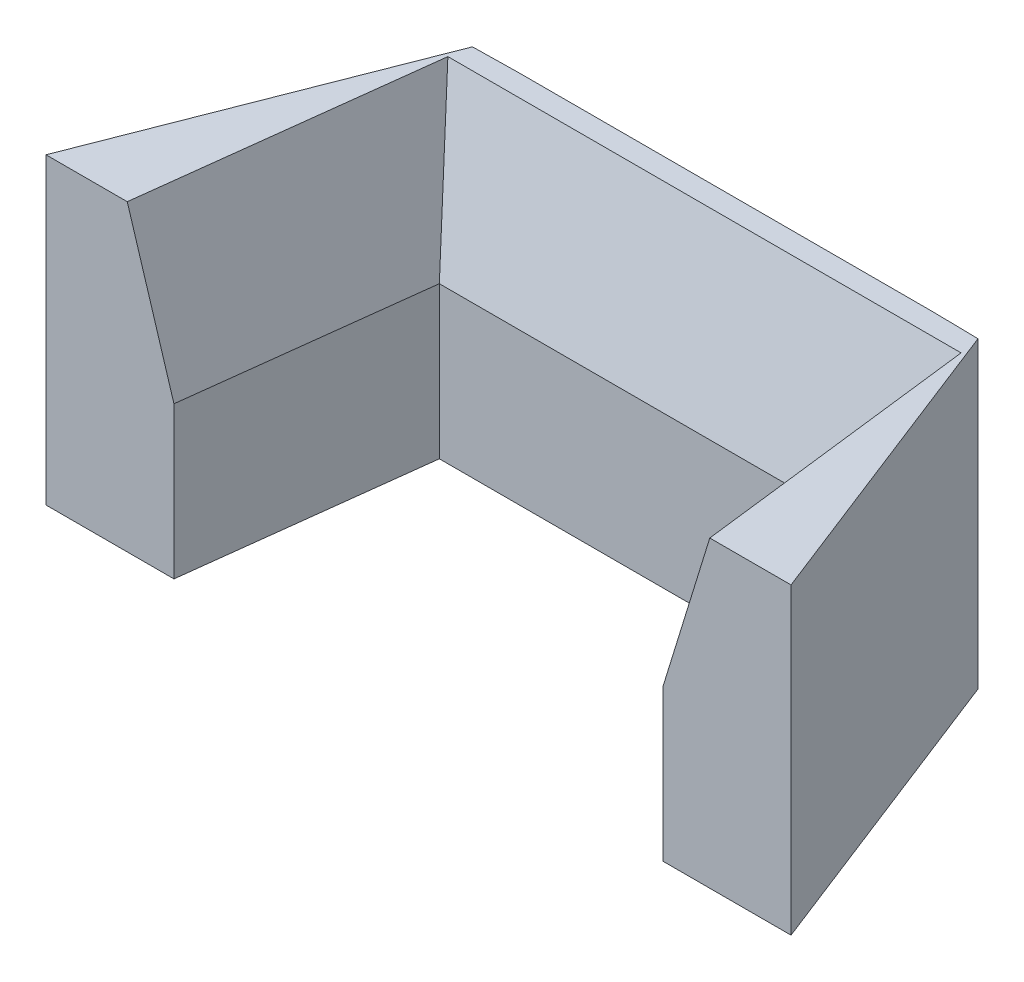
ISO-10303-21;
HEADER;
FILE_DESCRIPTION(('STEP AP214'),'2;1');
FILE_NAME('part.step','',(''),(''),'','','');
FILE_SCHEMA(('AUTOMOTIVE_DESIGN { 1 0 10303 214 1 1 1 1 }'));
ENDSEC;
DATA;
#1=APPLICATION_CONTEXT('core data for automotive mechanical design processes');
#2=APPLICATION_PROTOCOL_DEFINITION('international standard','automotive_design',2000,#1);
#3=PRODUCT_CONTEXT('',#1,'mechanical');
#4=PRODUCT('Part','Part','',(#3));
#5=PRODUCT_RELATED_PRODUCT_CATEGORY('part','',(#4));
#6=PRODUCT_DEFINITION_FORMATION('','',#4);
#7=PRODUCT_DEFINITION_CONTEXT('part definition',#1,'design');
#8=PRODUCT_DEFINITION('design','',#6,#7);
#9=PRODUCT_DEFINITION_SHAPE('','',#8);
#10=(LENGTH_UNIT() NAMED_UNIT(*) SI_UNIT(.MILLI.,.METRE.));
#11=(NAMED_UNIT(*) PLANE_ANGLE_UNIT() SI_UNIT($,.RADIAN.));
#12=(NAMED_UNIT(*) SI_UNIT($,.STERADIAN.) SOLID_ANGLE_UNIT());
#13=UNCERTAINTY_MEASURE_WITH_UNIT(LENGTH_MEASURE(1.E-05),#10,'distance_accuracy_value','');
#14=(GEOMETRIC_REPRESENTATION_CONTEXT(3) GLOBAL_UNCERTAINTY_ASSIGNED_CONTEXT((#13)) GLOBAL_UNIT_ASSIGNED_CONTEXT((#10,
#11,#12)) REPRESENTATION_CONTEXT('',''));
#15=CARTESIAN_POINT('',(0.,0.,0.));
#16=DIRECTION('',(0.,0.,1.));
#17=DIRECTION('',(1.,0.,0.));
#18=AXIS2_PLACEMENT_3D('',#15,#16,#17);
#19=CARTESIAN_POINT('',(0.,0.,0.));
#20=DIRECTION('',(0.,1.,0.));
#21=DIRECTION('',(0.,0.,1.));
#22=AXIS2_PLACEMENT_3D('',#19,#20,#21);
#23=PLANE('',#22);
#24=DIRECTION('',(0.363647232726733,0.,0.931536735792094));
#25=VECTOR('',#24,1.);
#26=CARTESIAN_POINT('',(55.1775190113047,0.,-21.5398398433811));
#27=LINE('',#26,#25);
#28=CARTESIAN_POINT('',(49.793050571942,0.,-35.3329604904691));
#29=VERTEX_POINT('',#28);
#30=CARTESIAN_POINT('',(61.6342337684254,0.,-5.));
#31=VERTEX_POINT('',#30);
#32=EDGE_CURVE('E221',#29,#31,#27,.T.);
#33=ORIENTED_EDGE('',*,*,#32,.T.);
#34=DIRECTION('',(-1.,0.,0.));
#35=VECTOR('',#34,1.);
#36=CARTESIAN_POINT('',(0.,0.,-5.));
#37=LINE('',#36,#35);
#38=CARTESIAN_POINT('',(48.9798849353082,0.,-5.));
#39=VERTEX_POINT('',#38);
#40=EDGE_CURVE('E249',#31,#39,#37,.T.);
#41=ORIENTED_EDGE('',*,*,#40,.T.);
#42=DIRECTION('',(-0.120361814384752,0.,-0.992730091030795));
#43=VECTOR('',#42,1.);
#44=CARTESIAN_POINT('',(48.8677489645903,0.,-5.92488429978922));
#45=LINE('',#44,#43);
#46=CARTESIAN_POINT('',(46.141753263948,0.,-28.4085762737028));
#47=VERTEX_POINT('',#46);
#48=EDGE_CURVE('E218',#39,#47,#45,.T.);
#49=ORIENTED_EDGE('',*,*,#48,.T.);
#50=DIRECTION('',(1.,0.,0.));
#51=VECTOR('',#50,1.);
#52=CARTESIAN_POINT('',(0.,0.,-28.4085762737027));
#53=LINE('',#52,#51);
#54=CARTESIAN_POINT('',(3.44434787993589,0.,-28.4085762737027));
#55=VERTEX_POINT('',#54);
#56=EDGE_CURVE('E215',#55,#47,#53,.T.);
#57=ORIENTED_EDGE('',*,*,#56,.F.);
#58=DIRECTION('',(0.120361814384752,0.,-0.992730091030795));
#59=VECTOR('',#58,1.);
#60=CARTESIAN_POINT('',(0.,0.,0.));
#61=LINE('',#60,#59);
#62=CARTESIAN_POINT('',(0.606216208575733,0.,-5.));
#63=VERTEX_POINT('',#62);
#64=EDGE_CURVE('E197',#63,#55,#61,.T.);
#65=ORIENTED_EDGE('',*,*,#64,.F.);
#66=CARTESIAN_POINT('',(-12.0481326245415,0.,-5.));
#67=VERTEX_POINT('',#66);
#68=EDGE_CURVE('E246',#63,#67,#37,.T.);
#69=ORIENTED_EDGE('',*,*,#68,.T.);
#70=DIRECTION('',(-0.363647232726733,0.,0.931536735792094));
#71=VECTOR('',#70,1.);
#72=CARTESIAN_POINT('',(-12.1486496618227,0.,-4.74251058615724));
#73=LINE('',#72,#71);
#74=CARTESIAN_POINT('',(-0.206949428058042,0.,-35.3329604904691));
#75=VERTEX_POINT('',#74);
#76=EDGE_CURVE('E202',#75,#67,#73,.T.);
#77=ORIENTED_EDGE('',*,*,#76,.F.);
#78=DIRECTION('',(-0.99985885095998,0.,0.0168011355863105));
#79=VECTOR('',#78,1.);
#80=CARTESIAN_POINT('',(-0.593608486319822,0.,-35.3264632621281));
#81=LINE('',#80,#79);
#82=CARTESIAN_POINT('',(4.29305057194196,0.,-35.4085762737027));
#83=VERTEX_POINT('',#82);
#84=EDGE_CURVE('E229',#83,#75,#81,.T.);
#85=ORIENTED_EDGE('',*,*,#84,.F.);
#86=DIRECTION('',(-1.,0.,0.));
#87=VECTOR('',#86,1.);
#88=CARTESIAN_POINT('',(0.,0.,-35.4085762737027));
#89=LINE('',#88,#87);
#90=CARTESIAN_POINT('',(45.293050571942,0.,-35.4085762737027));
#91=VERTEX_POINT('',#90);
#92=EDGE_CURVE('E227',#91,#83,#89,.T.);
#93=ORIENTED_EDGE('',*,*,#92,.F.);
#94=DIRECTION('',(0.99985885095998,0.,0.016801135586312));
#95=VECTOR('',#94,1.);
#96=CARTESIAN_POINT('',(0.607605559563074,0.,-36.1594484789814));
#97=LINE('',#96,#95);
#98=EDGE_CURVE('E224',#91,#29,#97,.T.);
#99=ORIENTED_EDGE('',*,*,#98,.T.);
#100=EDGE_LOOP('',(#33,#41,#49,#57,#65,#69,#77,#85,#93,#99));
#101=FACE_BOUND('',#100,.T.);
#102=DIRECTION('',(0.,0.,-1.));
#103=VECTOR('',#102,1.);
#104=CARTESIAN_POINT('',(14.793050571942,0.,-31.4085762737027));
#105=LINE('',#104,#103);
#106=CARTESIAN_POINT('',(14.793050571942,0.,-31.4085762737027));
#107=VERTEX_POINT('',#106);
#108=CARTESIAN_POINT('',(14.793050571942,0.,-33.4085762737027));
#109=VERTEX_POINT('',#108);
#110=EDGE_CURVE('E178',#107,#109,#105,.T.);
#111=ORIENTED_EDGE('',*,*,#110,.F.);
#112=DIRECTION('',(-1.,0.,0.));
#113=VECTOR('',#112,1.);
#114=CARTESIAN_POINT('',(14.793050571942,0.,-31.4085762737027));
#115=LINE('',#114,#113);
#116=CARTESIAN_POINT('',(34.793050571942,0.,-31.4085762737027));
#117=VERTEX_POINT('',#116);
#118=EDGE_CURVE('E175',#117,#107,#115,.T.);
#119=ORIENTED_EDGE('',*,*,#118,.F.);
#120=DIRECTION('',(0.,0.,1.));
#121=VECTOR('',#120,1.);
#122=CARTESIAN_POINT('',(34.793050571942,0.,-31.4085762737027));
#123=LINE('',#122,#121);
#124=CARTESIAN_POINT('',(34.793050571942,0.,-33.4085762737027));
#125=VERTEX_POINT('',#124);
#126=EDGE_CURVE('E512',#125,#117,#123,.T.);
#127=ORIENTED_EDGE('',*,*,#126,.F.);
#128=DIRECTION('',(1.,0.,0.));
#129=VECTOR('',#128,1.);
#130=CARTESIAN_POINT('',(14.793050571942,0.,-33.4085762737027));
#131=LINE('',#130,#129);
#132=EDGE_CURVE('E518',#109,#125,#131,.T.);
#133=ORIENTED_EDGE('',*,*,#132,.F.);
#134=EDGE_LOOP('',(#111,#119,#127,#133));
#135=FACE_BOUND('',#134,.T.);
#136=ADVANCED_FACE('F39',(#101,#135),#23,.F.);
#137=CARTESIAN_POINT('',(0.,30.,0.));
#138=DIRECTION('',(-0.992730091030795,0.,-0.120361814384752));
#139=DIRECTION('',(-0.120361814384752,0.,0.992730091030795));
#140=AXIS2_PLACEMENT_3D('',#137,#138,#139);
#141=PLANE('',#140);
#142=DIRECTION('',(0.,-1.,0.));
#143=VECTOR('',#142,1.);
#144=CARTESIAN_POINT('',(3.44434787993589,30.,-28.4085762737027));
#145=LINE('',#144,#143);
#146=CARTESIAN_POINT('',(3.44434787993589,14.9999999999998,-28.4085762737027));
#147=VERTEX_POINT('',#146);
#148=EDGE_CURVE('E244',#147,#55,#145,.T.);
#149=ORIENTED_EDGE('',*,*,#148,.F.);
#150=DIRECTION('',(-0.120361814384752,0.,0.992730091030795));
#151=VECTOR('',#150,1.);
#152=CARTESIAN_POINT('',(0.606216208575762,14.9999999999998,-5.));
#153=LINE('',#152,#151);
#154=CARTESIAN_POINT('',(0.606216208575763,14.9999999999998,-5.));
#155=VERTEX_POINT('',#154);
#156=EDGE_CURVE('E251',#147,#155,#153,.T.);
#157=ORIENTED_EDGE('',*,*,#156,.T.);
#158=DIRECTION('',(0.,-1.,0.));
#159=VECTOR('',#158,1.);
#160=CARTESIAN_POINT('',(0.606216208575763,30.,-5.));
#161=LINE('',#160,#159);
#162=EDGE_CURVE('E195',#155,#63,#161,.T.);
#163=ORIENTED_EDGE('',*,*,#162,.T.);
#164=ORIENTED_EDGE('',*,*,#64,.T.);
#165=EDGE_LOOP('',(#149,#157,#163,#164));
#166=FACE_BOUND('',#165,.T.);
#167=ADVANCED_FACE('F285',(#166),#141,.F.);
#168=CARTESIAN_POINT('',(0.,30.,-28.4085762737027));
#169=DIRECTION('',(0.,0.,-1.));
#170=DIRECTION('',(-1.,0.,0.));
#171=AXIS2_PLACEMENT_3D('',#168,#169,#170);
#172=PLANE('',#171);
#173=DIRECTION('',(0.,-1.,0.));
#174=VECTOR('',#173,1.);
#175=CARTESIAN_POINT('',(46.141753263948,30.,-28.4085762737028));
#176=LINE('',#175,#174);
#177=CARTESIAN_POINT('',(46.141753263948,14.9999999999998,-28.4085762737028));
#178=VERTEX_POINT('',#177);
#179=EDGE_CURVE('E242',#178,#47,#176,.T.);
#180=ORIENTED_EDGE('',*,*,#179,.F.);
#181=DIRECTION('',(-1.,0.,0.));
#182=VECTOR('',#181,1.);
#183=CARTESIAN_POINT('',(-1.17519600547017,14.9999999999998,-28.4085762737027));
#184=LINE('',#183,#182);
#185=EDGE_CURVE('E263',#178,#147,#184,.T.);
#186=ORIENTED_EDGE('',*,*,#185,.T.);
#187=ORIENTED_EDGE('',*,*,#148,.T.);
#188=ORIENTED_EDGE('',*,*,#56,.T.);
#189=EDGE_LOOP('',(#180,#186,#187,#188));
#190=FACE_BOUND('',#189,.T.);
#191=ADVANCED_FACE('F275',(#190),#172,.F.);
#192=CARTESIAN_POINT('',(48.8677489645903,30.,-5.92488429978922));
#193=DIRECTION('',(-0.992730091030795,0.,0.120361814384752));
#194=DIRECTION('',(0.120361814384752,0.,0.992730091030795));
#195=AXIS2_PLACEMENT_3D('',#192,#193,#194);
#196=PLANE('',#195);
#197=DIRECTION('',(0.,-1.,0.));
#198=VECTOR('',#197,1.);
#199=CARTESIAN_POINT('',(48.9798849353082,30.,-5.));
#200=LINE('',#199,#198);
#201=CARTESIAN_POINT('',(48.9798849353082,14.9999999999998,-5.));
#202=VERTEX_POINT('',#201);
#203=EDGE_CURVE('E193',#202,#39,#200,.T.);
#204=ORIENTED_EDGE('',*,*,#203,.F.);
#205=DIRECTION('',(-0.120361814384752,0.,-0.992730091030795));
#206=VECTOR('',#205,1.);
#207=CARTESIAN_POINT('',(48.8677489645903,14.9999999999998,-5.92488429978922));
#208=LINE('',#207,#206);
#209=EDGE_CURVE('E255',#202,#178,#208,.T.);
#210=ORIENTED_EDGE('',*,*,#209,.T.);
#211=ORIENTED_EDGE('',*,*,#179,.T.);
#212=ORIENTED_EDGE('',*,*,#48,.F.);
#213=EDGE_LOOP('',(#204,#210,#211,#212));
#214=FACE_BOUND('',#213,.T.);
#215=ADVANCED_FACE('F272',(#214),#196,.T.);
#216=CARTESIAN_POINT('',(55.1775190113047,30.,-21.5398398433811));
#217=DIRECTION('',(0.931536735792094,0.,-0.363647232726733));
#218=DIRECTION('',(-0.363647232726733,0.,-0.931536735792094));
#219=AXIS2_PLACEMENT_3D('',#216,#217,#218);
#220=PLANE('',#219);
#221=DIRECTION('',(0.,1.,0.));
#222=VECTOR('',#221,1.);
#223=CARTESIAN_POINT('',(61.6342337684255,30.,-5.));
#224=LINE('',#223,#222);
#225=CARTESIAN_POINT('',(61.6342337684254,30.,-5.));
#226=VERTEX_POINT('',#225);
#227=EDGE_CURVE('E190',#31,#226,#224,.T.);
#228=ORIENTED_EDGE('',*,*,#227,.F.);
#229=ORIENTED_EDGE('',*,*,#32,.F.);
#230=DIRECTION('',(0.,-1.,0.));
#231=VECTOR('',#230,1.);
#232=CARTESIAN_POINT('',(49.793050571942,30.,-35.3329604904691));
#233=LINE('',#232,#231);
#234=CARTESIAN_POINT('',(49.793050571942,30.,-35.3329604904691));
#235=VERTEX_POINT('',#234);
#236=EDGE_CURVE('E240',#235,#29,#233,.T.);
#237=ORIENTED_EDGE('',*,*,#236,.F.);
#238=DIRECTION('',(0.363647232726733,0.,0.931536735792094));
#239=VECTOR('',#238,1.);
#240=CARTESIAN_POINT('',(55.1775190113047,30.,-21.5398398433811));
#241=LINE('',#240,#239);
#242=EDGE_CURVE('E198',#235,#226,#241,.T.);
#243=ORIENTED_EDGE('',*,*,#242,.T.);
#244=EDGE_LOOP('',(#228,#229,#237,#243));
#245=FACE_BOUND('',#244,.T.);
#246=ADVANCED_FACE('F300',(#245),#220,.T.);
#247=CARTESIAN_POINT('',(0.607605559563074,30.,-36.1594484789814));
#248=DIRECTION('',(0.016801135586312,0.,-0.999858850959979));
#249=DIRECTION('',(-0.99985885095998,0.,-0.016801135586312));
#250=AXIS2_PLACEMENT_3D('',#247,#248,#249);
#251=PLANE('',#250);
#252=ORIENTED_EDGE('',*,*,#98,.F.);
#253=DIRECTION('',(0.,-1.,0.));
#254=VECTOR('',#253,1.);
#255=CARTESIAN_POINT('',(45.293050571942,30.,-35.4085762737027));
#256=LINE('',#255,#254);
#257=CARTESIAN_POINT('',(45.293050571942,30.,-35.4085762737027));
#258=VERTEX_POINT('',#257);
#259=EDGE_CURVE('E238',#258,#91,#256,.T.);
#260=ORIENTED_EDGE('',*,*,#259,.F.);
#261=DIRECTION('',(0.99985885095998,0.,0.016801135586312));
#262=VECTOR('',#261,1.);
#263=CARTESIAN_POINT('',(0.607605559563074,30.,-36.1594484789814));
#264=LINE('',#263,#262);
#265=EDGE_CURVE('E201',#258,#235,#264,.T.);
#266=ORIENTED_EDGE('',*,*,#265,.T.);
#267=ORIENTED_EDGE('',*,*,#236,.T.);
#268=EDGE_LOOP('',(#252,#260,#266,#267));
#269=FACE_BOUND('',#268,.T.);
#270=ADVANCED_FACE('F306',(#269),#251,.T.);
#271=CARTESIAN_POINT('',(0.,30.,-35.4085762737027));
#272=DIRECTION('',(0.,0.,1.));
#273=DIRECTION('',(1.,0.,0.));
#274=AXIS2_PLACEMENT_3D('',#271,#272,#273);
#275=PLANE('',#274);
#276=ORIENTED_EDGE('',*,*,#92,.T.);
#277=DIRECTION('',(0.,-1.,0.));
#278=VECTOR('',#277,1.);
#279=CARTESIAN_POINT('',(4.29305057194196,30.,-35.4085762737027));
#280=LINE('',#279,#278);
#281=CARTESIAN_POINT('',(4.29305057194196,30.,-35.4085762737027));
#282=VERTEX_POINT('',#281);
#283=EDGE_CURVE('E235',#282,#83,#280,.T.);
#284=ORIENTED_EDGE('',*,*,#283,.F.);
#285=DIRECTION('',(-1.,0.,0.));
#286=VECTOR('',#285,1.);
#287=CARTESIAN_POINT('',(0.,30.,-35.4085762737027));
#288=LINE('',#287,#286);
#289=EDGE_CURVE('E205',#258,#282,#288,.T.);
#290=ORIENTED_EDGE('',*,*,#289,.F.);
#291=ORIENTED_EDGE('',*,*,#259,.T.);
#292=EDGE_LOOP('',(#276,#284,#290,#291));
#293=FACE_BOUND('',#292,.T.);
#294=ADVANCED_FACE('F311',(#293),#275,.F.);
#295=CARTESIAN_POINT('',(-0.593608486319822,30.,-35.3264632621281));
#296=DIRECTION('',(0.0168011355863105,0.,0.99985885095998));
#297=DIRECTION('',(0.99985885095998,0.,-0.0168011355863105));
#298=AXIS2_PLACEMENT_3D('',#295,#296,#297);
#299=PLANE('',#298);
#300=ORIENTED_EDGE('',*,*,#84,.T.);
#301=DIRECTION('',(0.,-1.,0.));
#302=VECTOR('',#301,1.);
#303=CARTESIAN_POINT('',(-0.206949428058042,30.,-35.3329604904691));
#304=LINE('',#303,#302);
#305=CARTESIAN_POINT('',(-0.206949428058042,30.,-35.3329604904691));
#306=VERTEX_POINT('',#305);
#307=EDGE_CURVE('E212',#306,#75,#304,.T.);
#308=ORIENTED_EDGE('',*,*,#307,.F.);
#309=DIRECTION('',(-0.99985885095998,0.,0.0168011355863105));
#310=VECTOR('',#309,1.);
#311=CARTESIAN_POINT('',(-0.593608486319822,30.,-35.3264632621281));
#312=LINE('',#311,#310);
#313=EDGE_CURVE('E207',#282,#306,#312,.T.);
#314=ORIENTED_EDGE('',*,*,#313,.F.);
#315=ORIENTED_EDGE('',*,*,#283,.T.);
#316=EDGE_LOOP('',(#300,#308,#314,#315));
#317=FACE_BOUND('',#316,.T.);
#318=ADVANCED_FACE('F316',(#317),#299,.F.);
#319=CARTESIAN_POINT('',(-12.1486496618227,30.,-4.74251058615724));
#320=DIRECTION('',(0.931536735792094,0.,0.363647232726733));
#321=DIRECTION('',(0.363647232726733,0.,-0.931536735792094));
#322=AXIS2_PLACEMENT_3D('',#319,#320,#321);
#323=PLANE('',#322);
#324=ORIENTED_EDGE('',*,*,#76,.T.);
#325=DIRECTION('',(0.,1.,0.));
#326=VECTOR('',#325,1.);
#327=CARTESIAN_POINT('',(-12.0481326245415,30.,-5.));
#328=LINE('',#327,#326);
#329=CARTESIAN_POINT('',(-12.0481326245416,30.,-5.));
#330=VERTEX_POINT('',#329);
#331=EDGE_CURVE('E187',#67,#330,#328,.T.);
#332=ORIENTED_EDGE('',*,*,#331,.T.);
#333=DIRECTION('',(-0.363647232726733,0.,0.931536735792094));
#334=VECTOR('',#333,1.);
#335=CARTESIAN_POINT('',(-12.1486496618227,30.,-4.74251058615724));
#336=LINE('',#335,#334);
#337=EDGE_CURVE('E209',#306,#330,#336,.T.);
#338=ORIENTED_EDGE('',*,*,#337,.F.);
#339=ORIENTED_EDGE('',*,*,#307,.T.);
#340=EDGE_LOOP('',(#324,#332,#338,#339));
#341=FACE_BOUND('',#340,.T.);
#342=ADVANCED_FACE('F319',(#341),#323,.F.);
#343=CARTESIAN_POINT('',(0.,30.,0.));
#344=DIRECTION('',(0.,1.,0.));
#345=DIRECTION('',(0.,0.,1.));
#346=AXIS2_PLACEMENT_3D('',#343,#344,#345);
#347=PLANE('',#346);
#348=DIRECTION('',(1.,0.,0.));
#349=VECTOR('',#348,1.);
#350=CARTESIAN_POINT('',(50.7612971493541,30.,-33.2823717171964));
#351=LINE('',#350,#349);
#352=CARTESIAN_POINT('',(-0.584281246444469,30.,-33.2823717171963));
#353=VERTEX_POINT('',#352);
#354=CARTESIAN_POINT('',(50.1703823903284,30.,-33.2823717171964));
#355=VERTEX_POINT('',#354);
#356=EDGE_CURVE('E261',#353,#355,#351,.T.);
#357=ORIENTED_EDGE('',*,*,#356,.T.);
#358=DIRECTION('',(0.120361814384752,0.,0.992730091030795));
#359=VECTOR('',#358,1.);
#360=CARTESIAN_POINT('',(53.4203696731207,30.,-6.47685879279098));
#361=LINE('',#360,#359);
#362=CARTESIAN_POINT('',(53.5994288207142,30.,-5.));
#363=VERTEX_POINT('',#362);
#364=EDGE_CURVE('E55',#355,#363,#361,.T.);
#365=ORIENTED_EDGE('',*,*,#364,.T.);
#366=DIRECTION('',(1.,0.,0.));
#367=VECTOR('',#366,1.);
#368=CARTESIAN_POINT('',(-90.,30.,-5.));
#369=LINE('',#368,#367);
#370=EDGE_CURVE('E179',#363,#226,#369,.T.);
#371=ORIENTED_EDGE('',*,*,#370,.T.);
#372=ORIENTED_EDGE('',*,*,#242,.F.);
#373=ORIENTED_EDGE('',*,*,#265,.F.);
#374=ORIENTED_EDGE('',*,*,#289,.T.);
#375=ORIENTED_EDGE('',*,*,#313,.T.);
#376=ORIENTED_EDGE('',*,*,#337,.T.);
#377=CARTESIAN_POINT('',(-4.01332767683033,30.,-5.));
#378=VERTEX_POINT('',#377);
#379=EDGE_CURVE('E181',#330,#378,#369,.T.);
#380=ORIENTED_EDGE('',*,*,#379,.T.);
#381=DIRECTION('',(0.120361814384752,0.,-0.992730091030795));
#382=VECTOR('',#381,1.);
#383=CARTESIAN_POINT('',(-1.10827282859456,30.,-28.9605507667045));
#384=LINE('',#383,#382);
#385=EDGE_CURVE('E63',#378,#353,#384,.T.);
#386=ORIENTED_EDGE('',*,*,#385,.T.);
#387=EDGE_LOOP('',(#357,#365,#371,#372,#373,#374,#375,#376,#380,#386));
#388=FACE_BOUND('',#387,.T.);
#389=ADVANCED_FACE('F303',(#388),#347,.T.);
#390=CARTESIAN_POINT('',(-90.,0.,-5.));
#391=DIRECTION('',(0.,0.,-1.));
#392=DIRECTION('',(-1.,0.,0.));
#393=AXIS2_PLACEMENT_3D('',#390,#391,#392);
#394=PLANE('',#393);
#395=ORIENTED_EDGE('',*,*,#162,.F.);
#396=DIRECTION('',(-0.294327922497503,0.955704490958531,0.));
#397=VECTOR('',#396,1.);
#398=CARTESIAN_POINT('',(-4.06004605294511,30.1516980158877,-5.));
#399=LINE('',#398,#397);
#400=EDGE_CURVE('E253',#155,#378,#399,.T.);
#401=ORIENTED_EDGE('',*,*,#400,.T.);
#402=ORIENTED_EDGE('',*,*,#379,.F.);
#403=ORIENTED_EDGE('',*,*,#331,.F.);
#404=ORIENTED_EDGE('',*,*,#68,.F.);
#405=EDGE_LOOP('',(#395,#401,#402,#403,#404));
#406=FACE_BOUND('',#405,.T.);
#407=ADVANCED_FACE('F288',(#406),#394,.F.);
#408=ORIENTED_EDGE('',*,*,#370,.F.);
#409=DIRECTION('',(0.294327922497503,0.95570449095853,0.));
#410=VECTOR('',#409,1.);
#411=CARTESIAN_POINT('',(48.9701707166032,14.9684572147836,-5.));
#412=LINE('',#411,#410);
#413=EDGE_CURVE('E259',#363,#202,#412,.F.);
#414=ORIENTED_EDGE('',*,*,#413,.T.);
#415=ORIENTED_EDGE('',*,*,#203,.T.);
#416=ORIENTED_EDGE('',*,*,#40,.F.);
#417=ORIENTED_EDGE('',*,*,#227,.T.);
#418=EDGE_LOOP('',(#408,#414,#415,#416,#417));
#419=FACE_BOUND('',#418,.T.);
#420=ADVANCED_FACE('F298',(#419),#394,.F.);
#421=CARTESIAN_POINT('',(14.793050571942,-3.,-31.4085762737027));
#422=DIRECTION('',(1.,0.,0.));
#423=DIRECTION('',(0.,0.,-1.));
#424=AXIS2_PLACEMENT_3D('',#421,#422,#423);
#425=PLANE('',#424);
#426=ORIENTED_EDGE('',*,*,#110,.T.);
#427=DIRECTION('',(0.,1.,0.));
#428=VECTOR('',#427,1.);
#429=CARTESIAN_POINT('',(14.793050571942,-3.,-33.4085762737027));
#430=LINE('',#429,#428);
#431=CARTESIAN_POINT('',(14.793050571942,-3.,-33.4085762737027));
#432=VERTEX_POINT('',#431);
#433=EDGE_CURVE('E159',#432,#109,#430,.T.);
#434=ORIENTED_EDGE('',*,*,#433,.F.);
#435=DIRECTION('',(0.,0.,-1.));
#436=VECTOR('',#435,1.);
#437=CARTESIAN_POINT('',(14.793050571942,-3.,-31.4085762737027));
#438=LINE('',#437,#436);
#439=CARTESIAN_POINT('',(14.793050571942,-3.,-31.4085762737027));
#440=VERTEX_POINT('',#439);
#441=EDGE_CURVE('E166',#440,#432,#438,.T.);
#442=ORIENTED_EDGE('',*,*,#441,.F.);
#443=DIRECTION('',(0.,1.,0.));
#444=VECTOR('',#443,1.);
#445=CARTESIAN_POINT('',(14.793050571942,-3.,-31.4085762737027));
#446=LINE('',#445,#444);
#447=EDGE_CURVE('E509',#440,#107,#446,.T.);
#448=ORIENTED_EDGE('',*,*,#447,.T.);
#449=EDGE_LOOP('',(#426,#434,#442,#448));
#450=FACE_BOUND('',#449,.T.);
#451=ADVANCED_FACE('F177',(#450),#425,.F.);
#452=CARTESIAN_POINT('',(14.793050571942,-3.,-33.4085762737027));
#453=DIRECTION('',(0.,0.,1.));
#454=DIRECTION('',(1.,0.,0.));
#455=AXIS2_PLACEMENT_3D('',#452,#453,#454);
#456=PLANE('',#455);
#457=ORIENTED_EDGE('',*,*,#132,.T.);
#458=DIRECTION('',(0.,1.,0.));
#459=VECTOR('',#458,1.);
#460=CARTESIAN_POINT('',(34.793050571942,-3.,-33.4085762737027));
#461=LINE('',#460,#459);
#462=CARTESIAN_POINT('',(34.793050571942,-3.,-33.4085762737027));
#463=VERTEX_POINT('',#462);
#464=EDGE_CURVE('E162',#463,#125,#461,.T.);
#465=ORIENTED_EDGE('',*,*,#464,.F.);
#466=DIRECTION('',(1.,0.,0.));
#467=VECTOR('',#466,1.);
#468=CARTESIAN_POINT('',(14.793050571942,-3.,-33.4085762737027));
#469=LINE('',#468,#467);
#470=EDGE_CURVE('E154',#432,#463,#469,.T.);
#471=ORIENTED_EDGE('',*,*,#470,.F.);
#472=ORIENTED_EDGE('',*,*,#433,.T.);
#473=EDGE_LOOP('',(#457,#465,#471,#472));
#474=FACE_BOUND('',#473,.T.);
#475=ADVANCED_FACE('F157',(#474),#456,.F.);
#476=CARTESIAN_POINT('',(34.793050571942,-3.,-31.4085762737027));
#477=DIRECTION('',(-1.,0.,0.));
#478=DIRECTION('',(0.,0.,1.));
#479=AXIS2_PLACEMENT_3D('',#476,#477,#478);
#480=PLANE('',#479);
#481=ORIENTED_EDGE('',*,*,#126,.T.);
#482=DIRECTION('',(0.,1.,0.));
#483=VECTOR('',#482,1.);
#484=CARTESIAN_POINT('',(34.793050571942,-3.,-31.4085762737027));
#485=LINE('',#484,#483);
#486=CARTESIAN_POINT('',(34.793050571942,-3.,-31.4085762737027));
#487=VERTEX_POINT('',#486);
#488=EDGE_CURVE('E183',#487,#117,#485,.T.);
#489=ORIENTED_EDGE('',*,*,#488,.F.);
#490=DIRECTION('',(0.,0.,1.));
#491=VECTOR('',#490,1.);
#492=CARTESIAN_POINT('',(34.793050571942,-3.,-31.4085762737027));
#493=LINE('',#492,#491);
#494=EDGE_CURVE('E165',#463,#487,#493,.T.);
#495=ORIENTED_EDGE('',*,*,#494,.F.);
#496=ORIENTED_EDGE('',*,*,#464,.T.);
#497=EDGE_LOOP('',(#481,#489,#495,#496));
#498=FACE_BOUND('',#497,.T.);
#499=ADVANCED_FACE('F341',(#498),#480,.F.);
#500=CARTESIAN_POINT('',(14.793050571942,-3.,-31.4085762737027));
#501=DIRECTION('',(0.,0.,-1.));
#502=DIRECTION('',(-1.,0.,0.));
#503=AXIS2_PLACEMENT_3D('',#500,#501,#502);
#504=PLANE('',#503);
#505=ORIENTED_EDGE('',*,*,#118,.T.);
#506=ORIENTED_EDGE('',*,*,#447,.F.);
#507=DIRECTION('',(-1.,0.,0.));
#508=VECTOR('',#507,1.);
#509=CARTESIAN_POINT('',(14.793050571942,-3.,-31.4085762737027));
#510=LINE('',#509,#508);
#511=EDGE_CURVE('E171',#487,#440,#510,.T.);
#512=ORIENTED_EDGE('',*,*,#511,.F.);
#513=ORIENTED_EDGE('',*,*,#488,.T.);
#514=EDGE_LOOP('',(#505,#506,#512,#513));
#515=FACE_BOUND('',#514,.T.);
#516=ADVANCED_FACE('F344',(#515),#504,.F.);
#517=CARTESIAN_POINT('',(0.,-3.,0.));
#518=DIRECTION('',(0.,-1.,0.));
#519=DIRECTION('',(0.,0.,-1.));
#520=AXIS2_PLACEMENT_3D('',#517,#518,#519);
#521=PLANE('',#520);
#522=ORIENTED_EDGE('',*,*,#441,.T.);
#523=ORIENTED_EDGE('',*,*,#470,.T.);
#524=ORIENTED_EDGE('',*,*,#494,.T.);
#525=ORIENTED_EDGE('',*,*,#511,.T.);
#526=EDGE_LOOP('',(#522,#523,#524,#525));
#527=FACE_BOUND('',#526,.T.);
#528=ADVANCED_FACE('F169',(#527),#521,.T.);
#529=CARTESIAN_POINT('',(-4.55262070853045,30.,-0.551974493001766));
#530=DIRECTION('',(0.949352507440367,0.292371704722734,0.115102575532479));
#531=DIRECTION('',(-0.120361814384752,0.,0.992730091030795));
#532=AXIS2_PLACEMENT_3D('',#529,#530,#531);
#533=PLANE('',#532);
#534=ORIENTED_EDGE('',*,*,#400,.F.);
#535=ORIENTED_EDGE('',*,*,#156,.F.);
#536=DIRECTION('',(-0.247484315227753,0.921470954997472,-0.299404062785222));
#537=VECTOR('',#536,1.);
#538=CARTESIAN_POINT('',(-0.548494904535764,29.8667548906114,-33.2390777567293));
#539=LINE('',#538,#537);
#540=EDGE_CURVE('E11',#147,#353,#539,.T.);
#541=ORIENTED_EDGE('',*,*,#540,.T.);
#542=ORIENTED_EDGE('',*,*,#385,.F.);
#543=EDGE_LOOP('',(#534,#535,#541,#542));
#544=FACE_BOUND('',#543,.T.);
#545=ADVANCED_FACE('F282',(#544),#533,.T.);
#546=CARTESIAN_POINT('',(48.8677489645903,14.9999999999998,-5.92488429978922));
#547=DIRECTION('',(0.949352507440367,-0.292371704722734,-0.115102575532479));
#548=DIRECTION('',(-0.120361814384752,0.,-0.992730091030795));
#549=AXIS2_PLACEMENT_3D('',#546,#547,#548);
#550=PLANE('',#549);
#551=ORIENTED_EDGE('',*,*,#413,.F.);
#552=ORIENTED_EDGE('',*,*,#364,.F.);
#553=DIRECTION('',(0.247484315227754,0.921470954997472,-0.299404062785222));
#554=VECTOR('',#553,1.);
#555=CARTESIAN_POINT('',(47.0975224126439,18.5586639476337,-29.5648562825629));
#556=LINE('',#555,#554);
#557=EDGE_CURVE('E48',#355,#178,#556,.F.);
#558=ORIENTED_EDGE('',*,*,#557,.T.);
#559=ORIENTED_EDGE('',*,*,#209,.F.);
#560=EDGE_LOOP('',(#551,#552,#558,#559));
#561=FACE_BOUND('',#560,.T.);
#562=ADVANCED_FACE('F265',(#561),#550,.F.);
#563=CARTESIAN_POINT('',(0.,30.,-33.2823717171963));
#564=DIRECTION('',(0.,0.309016994374945,0.951056516295154));
#565=DIRECTION('',(-1.,0.,0.));
#566=AXIS2_PLACEMENT_3D('',#563,#564,#565);
#567=PLANE('',#566);
#568=ORIENTED_EDGE('',*,*,#540,.F.);
#569=ORIENTED_EDGE('',*,*,#185,.F.);
#570=ORIENTED_EDGE('',*,*,#557,.F.);
#571=ORIENTED_EDGE('',*,*,#356,.F.);
#572=EDGE_LOOP('',(#568,#569,#570,#571));
#573=FACE_BOUND('',#572,.T.);
#574=ADVANCED_FACE('F42',(#573),#567,.T.);
#575=CLOSED_SHELL('',(#136,#167,#191,#215,#246,#270,#294,#318,#342,#389,#407,#420,#451,#475,
#499,#516,#528,#545,#562,#574));
#576=MANIFOLD_SOLID_BREP('B2',#575);
#577=ADVANCED_BREP_SHAPE_REPRESENTATION('',(#18,#576),#14);
#578=SHAPE_DEFINITION_REPRESENTATION(#9,#577);
ENDSEC;
END-ISO-10303-21;
